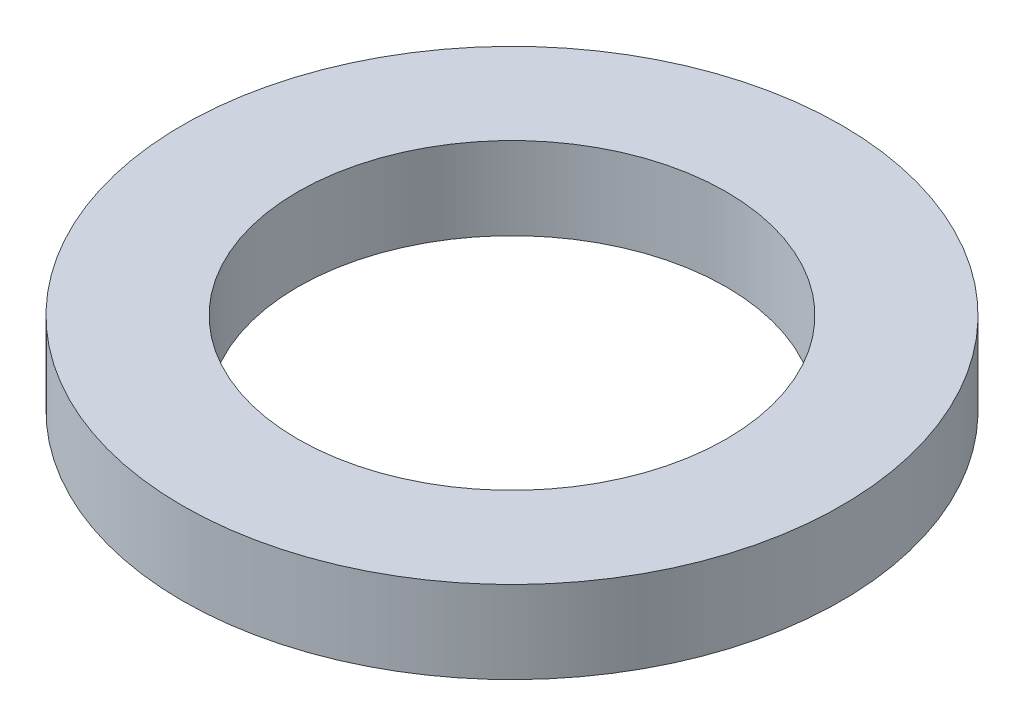
ISO-10303-21;
HEADER;
FILE_DESCRIPTION(('STEP AP214'),'2;1');
FILE_NAME('part.step','',(''),(''),'','','');
FILE_SCHEMA(('AUTOMOTIVE_DESIGN { 1 0 10303 214 1 1 1 1 }'));
ENDSEC;
DATA;
#1=APPLICATION_CONTEXT('core data for automotive mechanical design processes');
#2=APPLICATION_PROTOCOL_DEFINITION('international standard','automotive_design',2000,#1);
#3=PRODUCT_CONTEXT('',#1,'mechanical');
#4=PRODUCT('Part','Part','',(#3));
#5=PRODUCT_RELATED_PRODUCT_CATEGORY('part','',(#4));
#6=PRODUCT_DEFINITION_FORMATION('','',#4);
#7=PRODUCT_DEFINITION_CONTEXT('part definition',#1,'design');
#8=PRODUCT_DEFINITION('design','',#6,#7);
#9=PRODUCT_DEFINITION_SHAPE('','',#8);
#10=(LENGTH_UNIT() NAMED_UNIT(*) SI_UNIT(.MILLI.,.METRE.));
#11=(NAMED_UNIT(*) PLANE_ANGLE_UNIT() SI_UNIT($,.RADIAN.));
#12=(NAMED_UNIT(*) SI_UNIT($,.STERADIAN.) SOLID_ANGLE_UNIT());
#13=UNCERTAINTY_MEASURE_WITH_UNIT(LENGTH_MEASURE(1.E-05),#10,'distance_accuracy_value','');
#14=(GEOMETRIC_REPRESENTATION_CONTEXT(3) GLOBAL_UNCERTAINTY_ASSIGNED_CONTEXT((#13)) GLOBAL_UNIT_ASSIGNED_CONTEXT((#10,
#11,#12)) REPRESENTATION_CONTEXT('',''));
#15=CARTESIAN_POINT('',(0.,0.,0.));
#16=DIRECTION('',(0.,0.,1.));
#17=DIRECTION('',(1.,0.,0.));
#18=AXIS2_PLACEMENT_3D('',#15,#16,#17);
#19=CARTESIAN_POINT('',(0.,1.,0.));
#20=DIRECTION('',(0.,1.,0.));
#21=DIRECTION('',(0.,0.,1.));
#22=AXIS2_PLACEMENT_3D('',#19,#20,#21);
#23=PLANE('',#22);
#24=CARTESIAN_POINT('',(0.,1.,0.));
#25=DIRECTION('',(0.,1.,0.));
#26=DIRECTION('',(0.,0.,1.));
#27=AXIS2_PLACEMENT_3D('',#24,#25,#26);
#28=CIRCLE('',#27,4.);
#29=CARTESIAN_POINT('',(0.,1.,4.));
#30=VERTEX_POINT('',#29);
#31=EDGE_CURVE('E10',#30,#30,#28,.T.);
#32=ORIENTED_EDGE('',*,*,#31,.T.);
#33=EDGE_LOOP('',(#32));
#34=FACE_BOUND('',#33,.T.);
#35=CARTESIAN_POINT('',(0.,1.,0.));
#36=DIRECTION('',(0.,1.,0.));
#37=DIRECTION('',(0.,0.,1.));
#38=AXIS2_PLACEMENT_3D('',#35,#36,#37);
#39=CIRCLE('',#38,2.6);
#40=CARTESIAN_POINT('',(0.,1.,2.6));
#41=VERTEX_POINT('',#40);
#42=EDGE_CURVE('E42',#41,#41,#39,.T.);
#43=ORIENTED_EDGE('',*,*,#42,.F.);
#44=EDGE_LOOP('',(#43));
#45=FACE_BOUND('',#44,.T.);
#46=ADVANCED_FACE('F31',(#34,#45),#23,.T.);
#47=CARTESIAN_POINT('',(0.,0.,0.));
#48=DIRECTION('',(0.,1.,0.));
#49=DIRECTION('',(0.,0.,1.));
#50=AXIS2_PLACEMENT_3D('',#47,#48,#49);
#51=PLANE('',#50);
#52=CARTESIAN_POINT('',(0.,0.,0.));
#53=DIRECTION('',(0.,1.,0.));
#54=DIRECTION('',(0.,0.,1.));
#55=AXIS2_PLACEMENT_3D('',#52,#53,#54);
#56=CIRCLE('',#55,4.);
#57=CARTESIAN_POINT('',(0.,0.,4.));
#58=VERTEX_POINT('',#57);
#59=EDGE_CURVE('E35',#58,#58,#56,.T.);
#60=ORIENTED_EDGE('',*,*,#59,.F.);
#61=EDGE_LOOP('',(#60));
#62=FACE_BOUND('',#61,.T.);
#63=CARTESIAN_POINT('',(0.,0.,0.));
#64=DIRECTION('',(0.,1.,0.));
#65=DIRECTION('',(0.,0.,1.));
#66=AXIS2_PLACEMENT_3D('',#63,#64,#65);
#67=CIRCLE('',#66,2.6);
#68=CARTESIAN_POINT('',(0.,0.,2.6));
#69=VERTEX_POINT('',#68);
#70=EDGE_CURVE('E44',#69,#69,#67,.T.);
#71=ORIENTED_EDGE('',*,*,#70,.T.);
#72=EDGE_LOOP('',(#71));
#73=FACE_BOUND('',#72,.T.);
#74=ADVANCED_FACE('F54',(#62,#73),#51,.F.);
#75=CARTESIAN_POINT('',(0.,1.,0.));
#76=DIRECTION('',(0.,-1.,0.));
#77=DIRECTION('',(0.,0.,-1.));
#78=AXIS2_PLACEMENT_3D('',#75,#76,#77);
#79=CYLINDRICAL_SURFACE('',#78,4.);
#80=ORIENTED_EDGE('',*,*,#31,.F.);
#81=EDGE_LOOP('',(#80));
#82=FACE_BOUND('',#81,.T.);
#83=ORIENTED_EDGE('',*,*,#59,.T.);
#84=EDGE_LOOP('',(#83));
#85=FACE_BOUND('',#84,.T.);
#86=ADVANCED_FACE('F33',(#82,#85),#79,.T.);
#87=CARTESIAN_POINT('',(0.,1.,0.));
#88=DIRECTION('',(0.,-1.,0.));
#89=DIRECTION('',(0.,0.,-1.));
#90=AXIS2_PLACEMENT_3D('',#87,#88,#89);
#91=CYLINDRICAL_SURFACE('',#90,2.6);
#92=ORIENTED_EDGE('',*,*,#42,.T.);
#93=EDGE_LOOP('',(#92));
#94=FACE_BOUND('',#93,.T.);
#95=ORIENTED_EDGE('',*,*,#70,.F.);
#96=EDGE_LOOP('',(#95));
#97=FACE_BOUND('',#96,.T.);
#98=ADVANCED_FACE('F50',(#94,#97),#91,.F.);
#99=CLOSED_SHELL('',(#46,#74,#86,#98));
#100=MANIFOLD_SOLID_BREP('B2',#99);
#101=ADVANCED_BREP_SHAPE_REPRESENTATION('',(#18,#100),#14);
#102=SHAPE_DEFINITION_REPRESENTATION(#9,#101);
ENDSEC;
END-ISO-10303-21;
